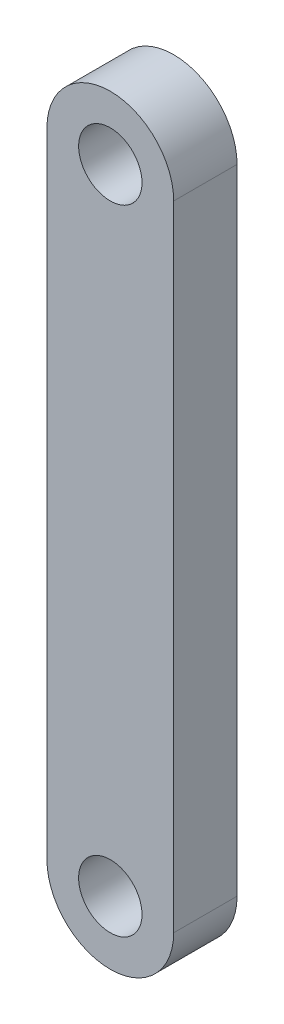
ISO-10303-21;
HEADER;
FILE_DESCRIPTION(('STEP AP214'),'2;1');
FILE_NAME('part.step','',(''),(''),'','','');
FILE_SCHEMA(('AUTOMOTIVE_DESIGN { 1 0 10303 214 1 1 1 1 }'));
ENDSEC;
DATA;
#1=APPLICATION_CONTEXT('core data for automotive mechanical design processes');
#2=APPLICATION_PROTOCOL_DEFINITION('international standard','automotive_design',2000,#1);
#3=PRODUCT_CONTEXT('',#1,'mechanical');
#4=PRODUCT('Part','Part','',(#3));
#5=PRODUCT_RELATED_PRODUCT_CATEGORY('part','',(#4));
#6=PRODUCT_DEFINITION_FORMATION('','',#4);
#7=PRODUCT_DEFINITION_CONTEXT('part definition',#1,'design');
#8=PRODUCT_DEFINITION('design','',#6,#7);
#9=PRODUCT_DEFINITION_SHAPE('','',#8);
#10=(LENGTH_UNIT() NAMED_UNIT(*) SI_UNIT(.MILLI.,.METRE.));
#11=(NAMED_UNIT(*) PLANE_ANGLE_UNIT() SI_UNIT($,.RADIAN.));
#12=(NAMED_UNIT(*) SI_UNIT($,.STERADIAN.) SOLID_ANGLE_UNIT());
#13=UNCERTAINTY_MEASURE_WITH_UNIT(LENGTH_MEASURE(1.E-05),#10,'distance_accuracy_value','');
#14=(GEOMETRIC_REPRESENTATION_CONTEXT(3) GLOBAL_UNCERTAINTY_ASSIGNED_CONTEXT((#13)) GLOBAL_UNIT_ASSIGNED_CONTEXT((#10,
#11,#12)) REPRESENTATION_CONTEXT('',''));
#15=CARTESIAN_POINT('',(0.,0.,0.));
#16=DIRECTION('',(0.,0.,1.));
#17=DIRECTION('',(1.,0.,0.));
#18=AXIS2_PLACEMENT_3D('',#15,#16,#17);
#19=CARTESIAN_POINT('',(0.,63.5,6.35));
#20=DIRECTION('',(0.,0.,1.));
#21=DIRECTION('',(1.,0.,0.));
#22=AXIS2_PLACEMENT_3D('',#19,#20,#21);
#23=PLANE('',#22);
#24=CARTESIAN_POINT('',(0.,0.,6.35));
#25=DIRECTION('',(0.,0.,1.));
#26=DIRECTION('',(1.,0.,0.));
#27=AXIS2_PLACEMENT_3D('',#24,#25,#26);
#28=CIRCLE('',#27,3.175);
#29=CARTESIAN_POINT('',(3.175,0.,6.35));
#30=VERTEX_POINT('',#29);
#31=EDGE_CURVE('E116',#30,#30,#28,.T.);
#32=ORIENTED_EDGE('',*,*,#31,.F.);
#33=EDGE_LOOP('',(#32));
#34=FACE_BOUND('',#33,.T.);
#35=CARTESIAN_POINT('',(0.,63.5,6.35));
#36=DIRECTION('',(0.,0.,1.));
#37=DIRECTION('',(1.,0.,0.));
#38=AXIS2_PLACEMENT_3D('',#35,#36,#37);
#39=CIRCLE('',#38,6.35);
#40=CARTESIAN_POINT('',(6.35,63.5,6.35));
#41=VERTEX_POINT('',#40);
#42=CARTESIAN_POINT('',(-6.35,63.5,6.35));
#43=VERTEX_POINT('',#42);
#44=EDGE_CURVE('E96',#41,#43,#39,.T.);
#45=ORIENTED_EDGE('',*,*,#44,.T.);
#46=DIRECTION('',(0.,-1.,0.));
#47=VECTOR('',#46,1.);
#48=CARTESIAN_POINT('',(-6.35,63.5,6.35));
#49=LINE('',#48,#47);
#50=CARTESIAN_POINT('',(-6.35,0.,6.35));
#51=VERTEX_POINT('',#50);
#52=EDGE_CURVE('E91',#43,#51,#49,.T.);
#53=ORIENTED_EDGE('',*,*,#52,.T.);
#54=CARTESIAN_POINT('',(0.,0.,6.35));
#55=DIRECTION('',(0.,0.,1.));
#56=DIRECTION('',(1.,0.,0.));
#57=AXIS2_PLACEMENT_3D('',#54,#55,#56);
#58=CIRCLE('',#57,6.35);
#59=CARTESIAN_POINT('',(6.35,0.,6.35));
#60=VERTEX_POINT('',#59);
#61=EDGE_CURVE('E94',#51,#60,#58,.T.);
#62=ORIENTED_EDGE('',*,*,#61,.T.);
#63=DIRECTION('',(0.,1.,0.));
#64=VECTOR('',#63,1.);
#65=CARTESIAN_POINT('',(6.35,63.5,6.35));
#66=LINE('',#65,#64);
#67=EDGE_CURVE('E61',#60,#41,#66,.T.);
#68=ORIENTED_EDGE('',*,*,#67,.T.);
#69=EDGE_LOOP('',(#45,#53,#62,#68));
#70=FACE_BOUND('',#69,.T.);
#71=CARTESIAN_POINT('',(0.,63.5,6.35));
#72=DIRECTION('',(0.,0.,1.));
#73=DIRECTION('',(1.,0.,0.));
#74=AXIS2_PLACEMENT_3D('',#71,#72,#73);
#75=CIRCLE('',#74,3.175);
#76=CARTESIAN_POINT('',(3.175,63.5,6.35));
#77=VERTEX_POINT('',#76);
#78=EDGE_CURVE('E138',#77,#77,#75,.T.);
#79=ORIENTED_EDGE('',*,*,#78,.F.);
#80=EDGE_LOOP('',(#79));
#81=FACE_BOUND('',#80,.T.);
#82=ADVANCED_FACE('F43',(#34,#70,#81),#23,.T.);
#83=CARTESIAN_POINT('',(0.,63.5,0.));
#84=DIRECTION('',(0.,0.,1.));
#85=DIRECTION('',(1.,0.,0.));
#86=AXIS2_PLACEMENT_3D('',#83,#84,#85);
#87=PLANE('',#86);
#88=CARTESIAN_POINT('',(0.,63.5,0.));
#89=DIRECTION('',(0.,0.,1.));
#90=DIRECTION('',(1.,0.,0.));
#91=AXIS2_PLACEMENT_3D('',#88,#89,#90);
#92=CIRCLE('',#91,6.35);
#93=CARTESIAN_POINT('',(6.35,63.5,0.));
#94=VERTEX_POINT('',#93);
#95=CARTESIAN_POINT('',(-6.35,63.5,0.));
#96=VERTEX_POINT('',#95);
#97=EDGE_CURVE('E112',#94,#96,#92,.T.);
#98=ORIENTED_EDGE('',*,*,#97,.F.);
#99=DIRECTION('',(0.,1.,0.));
#100=VECTOR('',#99,1.);
#101=CARTESIAN_POINT('',(6.35,63.5,0.));
#102=LINE('',#101,#100);
#103=CARTESIAN_POINT('',(6.35,0.,0.));
#104=VERTEX_POINT('',#103);
#105=EDGE_CURVE('E84',#104,#94,#102,.T.);
#106=ORIENTED_EDGE('',*,*,#105,.F.);
#107=CARTESIAN_POINT('',(0.,0.,0.));
#108=DIRECTION('',(0.,0.,1.));
#109=DIRECTION('',(1.,0.,0.));
#110=AXIS2_PLACEMENT_3D('',#107,#108,#109);
#111=CIRCLE('',#110,6.35);
#112=CARTESIAN_POINT('',(-6.35,0.,0.));
#113=VERTEX_POINT('',#112);
#114=EDGE_CURVE('E78',#113,#104,#111,.T.);
#115=ORIENTED_EDGE('',*,*,#114,.F.);
#116=DIRECTION('',(0.,-1.,0.));
#117=VECTOR('',#116,1.);
#118=CARTESIAN_POINT('',(-6.35,63.5,0.));
#119=LINE('',#118,#117);
#120=EDGE_CURVE('E101',#96,#113,#119,.T.);
#121=ORIENTED_EDGE('',*,*,#120,.F.);
#122=EDGE_LOOP('',(#98,#106,#115,#121));
#123=FACE_BOUND('',#122,.T.);
#124=CARTESIAN_POINT('',(0.,0.,0.));
#125=DIRECTION('',(0.,0.,1.));
#126=DIRECTION('',(1.,0.,0.));
#127=AXIS2_PLACEMENT_3D('',#124,#125,#126);
#128=CIRCLE('',#127,3.175);
#129=CARTESIAN_POINT('',(3.175,0.,0.));
#130=VERTEX_POINT('',#129);
#131=EDGE_CURVE('E134',#130,#130,#128,.T.);
#132=ORIENTED_EDGE('',*,*,#131,.T.);
#133=EDGE_LOOP('',(#132));
#134=FACE_BOUND('',#133,.T.);
#135=CARTESIAN_POINT('',(0.,63.5,0.));
#136=DIRECTION('',(0.,0.,1.));
#137=DIRECTION('',(1.,0.,0.));
#138=AXIS2_PLACEMENT_3D('',#135,#136,#137);
#139=CIRCLE('',#138,3.175);
#140=CARTESIAN_POINT('',(3.175,63.5,0.));
#141=VERTEX_POINT('',#140);
#142=EDGE_CURVE('E142',#141,#141,#139,.T.);
#143=ORIENTED_EDGE('',*,*,#142,.T.);
#144=EDGE_LOOP('',(#143));
#145=FACE_BOUND('',#144,.T.);
#146=ADVANCED_FACE('F129',(#123,#134,#145),#87,.F.);
#147=CARTESIAN_POINT('',(0.,63.5,6.35));
#148=DIRECTION('',(0.,0.,-1.));
#149=DIRECTION('',(-1.,0.,0.));
#150=AXIS2_PLACEMENT_3D('',#147,#148,#149);
#151=CYLINDRICAL_SURFACE('',#150,6.35);
#152=ORIENTED_EDGE('',*,*,#97,.T.);
#153=DIRECTION('',(0.,0.,-1.));
#154=VECTOR('',#153,1.);
#155=CARTESIAN_POINT('',(-6.35,63.5,6.35));
#156=LINE('',#155,#154);
#157=EDGE_CURVE('E11',#43,#96,#156,.T.);
#158=ORIENTED_EDGE('',*,*,#157,.F.);
#159=ORIENTED_EDGE('',*,*,#44,.F.);
#160=DIRECTION('',(0.,0.,-1.));
#161=VECTOR('',#160,1.);
#162=CARTESIAN_POINT('',(6.35,63.5,6.35));
#163=LINE('',#162,#161);
#164=EDGE_CURVE('E108',#41,#94,#163,.T.);
#165=ORIENTED_EDGE('',*,*,#164,.T.);
#166=EDGE_LOOP('',(#152,#158,#159,#165));
#167=FACE_BOUND('',#166,.T.);
#168=ADVANCED_FACE('F45',(#167),#151,.T.);
#169=CARTESIAN_POINT('',(-6.35,63.5,6.35));
#170=DIRECTION('',(1.,0.,0.));
#171=DIRECTION('',(0.,0.,-1.));
#172=AXIS2_PLACEMENT_3D('',#169,#170,#171);
#173=PLANE('',#172);
#174=ORIENTED_EDGE('',*,*,#120,.T.);
#175=DIRECTION('',(0.,0.,-1.));
#176=VECTOR('',#175,1.);
#177=CARTESIAN_POINT('',(-6.35,0.,6.35));
#178=LINE('',#177,#176);
#179=EDGE_CURVE('E53',#51,#113,#178,.T.);
#180=ORIENTED_EDGE('',*,*,#179,.F.);
#181=ORIENTED_EDGE('',*,*,#52,.F.);
#182=ORIENTED_EDGE('',*,*,#157,.T.);
#183=EDGE_LOOP('',(#174,#180,#181,#182));
#184=FACE_BOUND('',#183,.T.);
#185=ADVANCED_FACE('F100',(#184),#173,.F.);
#186=CARTESIAN_POINT('',(0.,0.,6.35));
#187=DIRECTION('',(0.,0.,-1.));
#188=DIRECTION('',(-1.,0.,0.));
#189=AXIS2_PLACEMENT_3D('',#186,#187,#188);
#190=CYLINDRICAL_SURFACE('',#189,6.35);
#191=ORIENTED_EDGE('',*,*,#114,.T.);
#192=DIRECTION('',(0.,0.,-1.));
#193=VECTOR('',#192,1.);
#194=CARTESIAN_POINT('',(6.35,0.,6.35));
#195=LINE('',#194,#193);
#196=EDGE_CURVE('E103',#60,#104,#195,.T.);
#197=ORIENTED_EDGE('',*,*,#196,.F.);
#198=ORIENTED_EDGE('',*,*,#61,.F.);
#199=ORIENTED_EDGE('',*,*,#179,.T.);
#200=EDGE_LOOP('',(#191,#197,#198,#199));
#201=FACE_BOUND('',#200,.T.);
#202=ADVANCED_FACE('F104',(#201),#190,.T.);
#203=CARTESIAN_POINT('',(6.35,63.5,6.35));
#204=DIRECTION('',(-1.,0.,0.));
#205=DIRECTION('',(0.,0.,1.));
#206=AXIS2_PLACEMENT_3D('',#203,#204,#205);
#207=PLANE('',#206);
#208=ORIENTED_EDGE('',*,*,#105,.T.);
#209=ORIENTED_EDGE('',*,*,#164,.F.);
#210=ORIENTED_EDGE('',*,*,#67,.F.);
#211=ORIENTED_EDGE('',*,*,#196,.T.);
#212=EDGE_LOOP('',(#208,#209,#210,#211));
#213=FACE_BOUND('',#212,.T.);
#214=ADVANCED_FACE('F126',(#213),#207,.F.);
#215=CARTESIAN_POINT('',(0.,0.,6.35));
#216=DIRECTION('',(0.,0.,-1.));
#217=DIRECTION('',(-1.,0.,0.));
#218=AXIS2_PLACEMENT_3D('',#215,#216,#217);
#219=CYLINDRICAL_SURFACE('',#218,3.175);
#220=ORIENTED_EDGE('',*,*,#31,.T.);
#221=EDGE_LOOP('',(#220));
#222=FACE_BOUND('',#221,.T.);
#223=ORIENTED_EDGE('',*,*,#131,.F.);
#224=EDGE_LOOP('',(#223));
#225=FACE_BOUND('',#224,.T.);
#226=ADVANCED_FACE('F161',(#222,#225),#219,.F.);
#227=CARTESIAN_POINT('',(0.,63.5,6.35));
#228=DIRECTION('',(0.,0.,-1.));
#229=DIRECTION('',(-1.,0.,0.));
#230=AXIS2_PLACEMENT_3D('',#227,#228,#229);
#231=CYLINDRICAL_SURFACE('',#230,3.175);
#232=ORIENTED_EDGE('',*,*,#78,.T.);
#233=EDGE_LOOP('',(#232));
#234=FACE_BOUND('',#233,.T.);
#235=ORIENTED_EDGE('',*,*,#142,.F.);
#236=EDGE_LOOP('',(#235));
#237=FACE_BOUND('',#236,.T.);
#238=ADVANCED_FACE('F150',(#234,#237),#231,.F.);
#239=CLOSED_SHELL('',(#82,#146,#168,#185,#202,#214,#226,#238));
#240=MANIFOLD_SOLID_BREP('B2',#239);
#241=ADVANCED_BREP_SHAPE_REPRESENTATION('',(#18,#240),#14);
#242=SHAPE_DEFINITION_REPRESENTATION(#9,#241);
ENDSEC;
END-ISO-10303-21;
